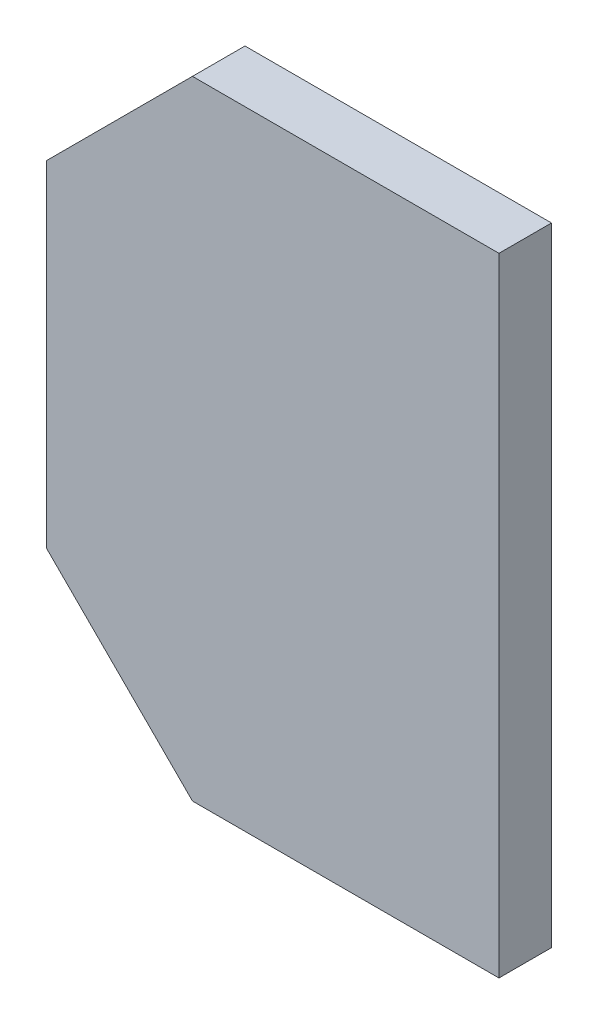
ISO-10303-21;
HEADER;
FILE_DESCRIPTION(('STEP AP214'),'2;1');
FILE_NAME('part.step','',(''),(''),'','','');
FILE_SCHEMA(('AUTOMOTIVE_DESIGN { 1 0 10303 214 1 1 1 1 }'));
ENDSEC;
DATA;
#1=APPLICATION_CONTEXT('core data for automotive mechanical design processes');
#2=APPLICATION_PROTOCOL_DEFINITION('international standard','automotive_design',2000,#1);
#3=PRODUCT_CONTEXT('',#1,'mechanical');
#4=PRODUCT('Part','Part','',(#3));
#5=PRODUCT_RELATED_PRODUCT_CATEGORY('part','',(#4));
#6=PRODUCT_DEFINITION_FORMATION('','',#4);
#7=PRODUCT_DEFINITION_CONTEXT('part definition',#1,'design');
#8=PRODUCT_DEFINITION('design','',#6,#7);
#9=PRODUCT_DEFINITION_SHAPE('','',#8);
#10=(LENGTH_UNIT() NAMED_UNIT(*) SI_UNIT(.MILLI.,.METRE.));
#11=(NAMED_UNIT(*) PLANE_ANGLE_UNIT() SI_UNIT($,.RADIAN.));
#12=(NAMED_UNIT(*) SI_UNIT($,.STERADIAN.) SOLID_ANGLE_UNIT());
#13=UNCERTAINTY_MEASURE_WITH_UNIT(LENGTH_MEASURE(1.E-05),#10,'distance_accuracy_value','');
#14=(GEOMETRIC_REPRESENTATION_CONTEXT(3) GLOBAL_UNCERTAINTY_ASSIGNED_CONTEXT((#13)) GLOBAL_UNIT_ASSIGNED_CONTEXT((#10,
#11,#12)) REPRESENTATION_CONTEXT('',''));
#15=CARTESIAN_POINT('',(0.,0.,0.));
#16=DIRECTION('',(0.,0.,1.));
#17=DIRECTION('',(1.,0.,0.));
#18=AXIS2_PLACEMENT_3D('',#15,#16,#17);
#19=CARTESIAN_POINT('',(-0.18,0.,0.));
#20=DIRECTION('',(0.,0.,-1.));
#21=DIRECTION('',(-1.,0.,0.));
#22=AXIS2_PLACEMENT_3D('',#19,#20,#21);
#23=PLANE('',#22);
#24=DIRECTION('',(-0.707106781186547,-0.707106781186548,0.));
#25=VECTOR('',#24,1.);
#26=CARTESIAN_POINT('',(-0.24,0.075,0.));
#27=LINE('',#26,#25);
#28=CARTESIAN_POINT('',(-0.2075,0.1075,0.));
#29=VERTEX_POINT('',#28);
#30=CARTESIAN_POINT('',(-0.2575,0.0575000000000001,0.));
#31=VERTEX_POINT('',#30);
#32=EDGE_CURVE('E11',#29,#31,#27,.T.);
#33=ORIENTED_EDGE('',*,*,#32,.F.);
#34=DIRECTION('',(-1.,0.,0.));
#35=VECTOR('',#34,1.);
#36=CARTESIAN_POINT('',(-0.14125,0.1075,0.));
#37=LINE('',#36,#35);
#38=CARTESIAN_POINT('',(-0.1025,0.1075,0.));
#39=VERTEX_POINT('',#38);
#40=EDGE_CURVE('E24',#39,#29,#37,.T.);
#41=ORIENTED_EDGE('',*,*,#40,.F.);
#42=DIRECTION('',(0.,1.,0.));
#43=VECTOR('',#42,1.);
#44=CARTESIAN_POINT('',(-0.1025,-0.05375,0.));
#45=LINE('',#44,#43);
#46=CARTESIAN_POINT('',(-0.1025,-0.1075,0.));
#47=VERTEX_POINT('',#46);
#48=EDGE_CURVE('E115',#47,#39,#45,.T.);
#49=ORIENTED_EDGE('',*,*,#48,.F.);
#50=DIRECTION('',(1.,0.,0.));
#51=VECTOR('',#50,1.);
#52=CARTESIAN_POINT('',(-0.21875,-0.1075,0.));
#53=LINE('',#52,#51);
#54=CARTESIAN_POINT('',(-0.2075,-0.1075,0.));
#55=VERTEX_POINT('',#54);
#56=EDGE_CURVE('E112',#55,#47,#53,.T.);
#57=ORIENTED_EDGE('',*,*,#56,.F.);
#58=DIRECTION('',(0.707106781186547,-0.707106781186548,0.));
#59=VECTOR('',#58,1.);
#60=CARTESIAN_POINT('',(-0.24,-0.0749999999999999,0.));
#61=LINE('',#60,#59);
#62=CARTESIAN_POINT('',(-0.2575,-0.0574999999999999,0.));
#63=VERTEX_POINT('',#62);
#64=EDGE_CURVE('E109',#63,#55,#61,.T.);
#65=ORIENTED_EDGE('',*,*,#64,.F.);
#66=DIRECTION('',(0.,-1.,0.));
#67=VECTOR('',#66,1.);
#68=CARTESIAN_POINT('',(-0.2575,0.0537500000000001,0.));
#69=LINE('',#68,#67);
#70=EDGE_CURVE('E106',#31,#63,#69,.T.);
#71=ORIENTED_EDGE('',*,*,#70,.F.);
#72=EDGE_LOOP('',(#33,#41,#49,#57,#65,#71));
#73=FACE_BOUND('',#72,.T.);
#74=ADVANCED_FACE('F17',(#73),#23,.T.);
#75=CARTESIAN_POINT('',(-0.2575,-0.1075,0.0179999999999999));
#76=DIRECTION('',(0.,1.,0.));
#77=DIRECTION('',(1.,0.,0.));
#78=AXIS2_PLACEMENT_3D('',#75,#76,#77);
#79=PLANE('',#78);
#80=DIRECTION('',(0.,0.,1.));
#81=VECTOR('',#80,1.);
#82=CARTESIAN_POINT('',(-0.2075,-0.1075,0.0179999999999999));
#83=LINE('',#82,#81);
#84=CARTESIAN_POINT('',(-0.2075,-0.1075,0.018));
#85=VERTEX_POINT('',#84);
#86=EDGE_CURVE('E104',#55,#85,#83,.T.);
#87=ORIENTED_EDGE('',*,*,#86,.F.);
#88=ORIENTED_EDGE('',*,*,#56,.T.);
#89=DIRECTION('',(0.,0.,-1.));
#90=VECTOR('',#89,1.);
#91=CARTESIAN_POINT('',(-0.1025,-0.1075,0.018));
#92=LINE('',#91,#90);
#93=CARTESIAN_POINT('',(-0.1025,-0.1075,0.018));
#94=VERTEX_POINT('',#93);
#95=EDGE_CURVE('E101',#94,#47,#92,.T.);
#96=ORIENTED_EDGE('',*,*,#95,.F.);
#97=DIRECTION('',(1.,0.,0.));
#98=VECTOR('',#97,1.);
#99=CARTESIAN_POINT('',(-0.3043863753,-0.1075,0.0180000000000001));
#100=LINE('',#99,#98);
#101=EDGE_CURVE('E99',#85,#94,#100,.T.);
#102=ORIENTED_EDGE('',*,*,#101,.F.);
#103=EDGE_LOOP('',(#87,#88,#96,#102));
#104=FACE_BOUND('',#103,.T.);
#105=ADVANCED_FACE('F121',(#104),#79,.F.);
#106=CARTESIAN_POINT('',(-0.1025,-0.1075,0.018));
#107=DIRECTION('',(-1.,0.,0.));
#108=DIRECTION('',(0.,1.,0.));
#109=AXIS2_PLACEMENT_3D('',#106,#107,#108);
#110=PLANE('',#109);
#111=ORIENTED_EDGE('',*,*,#48,.T.);
#112=DIRECTION('',(0.,0.,-1.));
#113=VECTOR('',#112,1.);
#114=CARTESIAN_POINT('',(-0.1025,0.1075,0.018));
#115=LINE('',#114,#113);
#116=CARTESIAN_POINT('',(-0.1025,0.1075,0.018));
#117=VERTEX_POINT('',#116);
#118=EDGE_CURVE('E97',#117,#39,#115,.T.);
#119=ORIENTED_EDGE('',*,*,#118,.F.);
#120=DIRECTION('',(0.,1.,0.));
#121=VECTOR('',#120,1.);
#122=CARTESIAN_POINT('',(-0.1025,0.0212499999999999,0.018));
#123=LINE('',#122,#121);
#124=EDGE_CURVE('E81',#94,#117,#123,.T.);
#125=ORIENTED_EDGE('',*,*,#124,.F.);
#126=ORIENTED_EDGE('',*,*,#95,.T.);
#127=EDGE_LOOP('',(#111,#119,#125,#126));
#128=FACE_BOUND('',#127,.T.);
#129=ADVANCED_FACE('F118',(#128),#110,.F.);
#130=CARTESIAN_POINT('',(-0.2575,0.1075,0.0179999999999999));
#131=DIRECTION('',(1.,0.,0.));
#132=DIRECTION('',(0.,-1.,0.));
#133=AXIS2_PLACEMENT_3D('',#130,#131,#132);
#134=PLANE('',#133);
#135=DIRECTION('',(0.,0.,1.));
#136=VECTOR('',#135,1.);
#137=CARTESIAN_POINT('',(-0.2575,0.0575000000000001,0.0179999999999999));
#138=LINE('',#137,#136);
#139=CARTESIAN_POINT('',(-0.2575,0.0575000000000001,0.018));
#140=VERTEX_POINT('',#139);
#141=EDGE_CURVE('E85',#31,#140,#138,.T.);
#142=ORIENTED_EDGE('',*,*,#141,.F.);
#143=ORIENTED_EDGE('',*,*,#70,.T.);
#144=DIRECTION('',(0.,0.,-1.));
#145=VECTOR('',#144,1.);
#146=CARTESIAN_POINT('',(-0.2575,-0.0574999999999999,0.0179999999999999));
#147=LINE('',#146,#145);
#148=CARTESIAN_POINT('',(-0.2575,-0.0574999999999999,0.018));
#149=VERTEX_POINT('',#148);
#150=EDGE_CURVE('E92',#149,#63,#147,.T.);
#151=ORIENTED_EDGE('',*,*,#150,.F.);
#152=DIRECTION('',(0.,-1.,0.));
#153=VECTOR('',#152,1.);
#154=CARTESIAN_POINT('',(-0.2575,0.12875,0.018));
#155=LINE('',#154,#153);
#156=EDGE_CURVE('E90',#140,#149,#155,.T.);
#157=ORIENTED_EDGE('',*,*,#156,.F.);
#158=EDGE_LOOP('',(#142,#143,#151,#157));
#159=FACE_BOUND('',#158,.T.);
#160=ADVANCED_FACE('F127',(#159),#134,.F.);
#161=CARTESIAN_POINT('',(-0.2325,-0.0824999999999999,0.0179999999999999));
#162=DIRECTION('',(-0.707106781186548,-0.707106781186547,0.));
#163=DIRECTION('',(0.,0.,1.));
#164=AXIS2_PLACEMENT_3D('',#161,#162,#163);
#165=PLANE('',#164);
#166=ORIENTED_EDGE('',*,*,#64,.T.);
#167=ORIENTED_EDGE('',*,*,#86,.T.);
#168=DIRECTION('',(0.707106781186547,-0.707106781186548,0.));
#169=VECTOR('',#168,1.);
#170=CARTESIAN_POINT('',(-0.32031818765,0.00531818765000022,0.0180000000000001));
#171=LINE('',#170,#169);
#172=EDGE_CURVE('E70',#149,#85,#171,.T.);
#173=ORIENTED_EDGE('',*,*,#172,.F.);
#174=ORIENTED_EDGE('',*,*,#150,.T.);
#175=EDGE_LOOP('',(#166,#167,#173,#174));
#176=FACE_BOUND('',#175,.T.);
#177=ADVANCED_FACE('F125',(#176),#165,.T.);
#178=CARTESIAN_POINT('',(-0.1025,0.1075,0.018));
#179=DIRECTION('',(0.,-1.,0.));
#180=DIRECTION('',(-1.,0.,0.));
#181=AXIS2_PLACEMENT_3D('',#178,#179,#180);
#182=PLANE('',#181);
#183=DIRECTION('',(0.,0.,-1.));
#184=VECTOR('',#183,1.);
#185=CARTESIAN_POINT('',(-0.2075,0.1075,0.0179999999999999));
#186=LINE('',#185,#184);
#187=CARTESIAN_POINT('',(-0.2075,0.1075,0.018));
#188=VERTEX_POINT('',#187);
#189=EDGE_CURVE('E64',#188,#29,#186,.T.);
#190=ORIENTED_EDGE('',*,*,#189,.F.);
#191=DIRECTION('',(-1.,0.,0.));
#192=VECTOR('',#191,1.);
#193=CARTESIAN_POINT('',(-0.2268863753,0.1075,0.018));
#194=LINE('',#193,#192);
#195=EDGE_CURVE('E68',#117,#188,#194,.T.);
#196=ORIENTED_EDGE('',*,*,#195,.F.);
#197=ORIENTED_EDGE('',*,*,#118,.T.);
#198=ORIENTED_EDGE('',*,*,#40,.T.);
#199=EDGE_LOOP('',(#190,#196,#197,#198));
#200=FACE_BOUND('',#199,.T.);
#201=ADVANCED_FACE('F66',(#200),#182,.F.);
#202=CARTESIAN_POINT('',(-0.2325,0.0825000000000001,0.0179999999999999));
#203=DIRECTION('',(-0.707106781186548,0.707106781186547,0.));
#204=DIRECTION('',(0.,0.,1.));
#205=AXIS2_PLACEMENT_3D('',#202,#203,#204);
#206=PLANE('',#205);
#207=ORIENTED_EDGE('',*,*,#32,.T.);
#208=ORIENTED_EDGE('',*,*,#141,.T.);
#209=DIRECTION('',(-0.707106781186547,-0.707106781186548,0.));
#210=VECTOR('',#209,1.);
#211=CARTESIAN_POINT('',(-0.24531818765,0.0696818123499999,0.018));
#212=LINE('',#211,#210);
#213=EDGE_CURVE('E78',#188,#140,#212,.T.);
#214=ORIENTED_EDGE('',*,*,#213,.F.);
#215=ORIENTED_EDGE('',*,*,#189,.T.);
#216=EDGE_LOOP('',(#207,#208,#214,#215));
#217=FACE_BOUND('',#216,.T.);
#218=ADVANCED_FACE('F83',(#217),#206,.T.);
#219=CARTESIAN_POINT('',(0.,0.,0.018));
#220=DIRECTION('',(0.,0.,1.));
#221=DIRECTION('',(1.,0.,0.));
#222=AXIS2_PLACEMENT_3D('',#219,#220,#221);
#223=PLANE('',#222);
#224=ORIENTED_EDGE('',*,*,#172,.T.);
#225=ORIENTED_EDGE('',*,*,#101,.T.);
#226=ORIENTED_EDGE('',*,*,#124,.T.);
#227=ORIENTED_EDGE('',*,*,#195,.T.);
#228=ORIENTED_EDGE('',*,*,#213,.T.);
#229=ORIENTED_EDGE('',*,*,#156,.T.);
#230=EDGE_LOOP('',(#224,#225,#226,#227,#228,#229));
#231=FACE_BOUND('',#230,.T.);
#232=ADVANCED_FACE('F76',(#231),#223,.T.);
#233=CLOSED_SHELL('',(#74,#105,#129,#160,#177,#201,#218,#232));
#234=MANIFOLD_SOLID_BREP('B1',#233);
#235=ADVANCED_BREP_SHAPE_REPRESENTATION('',(#18,#234),#14);
#236=SHAPE_DEFINITION_REPRESENTATION(#9,#235);
ENDSEC;
END-ISO-10303-21;
